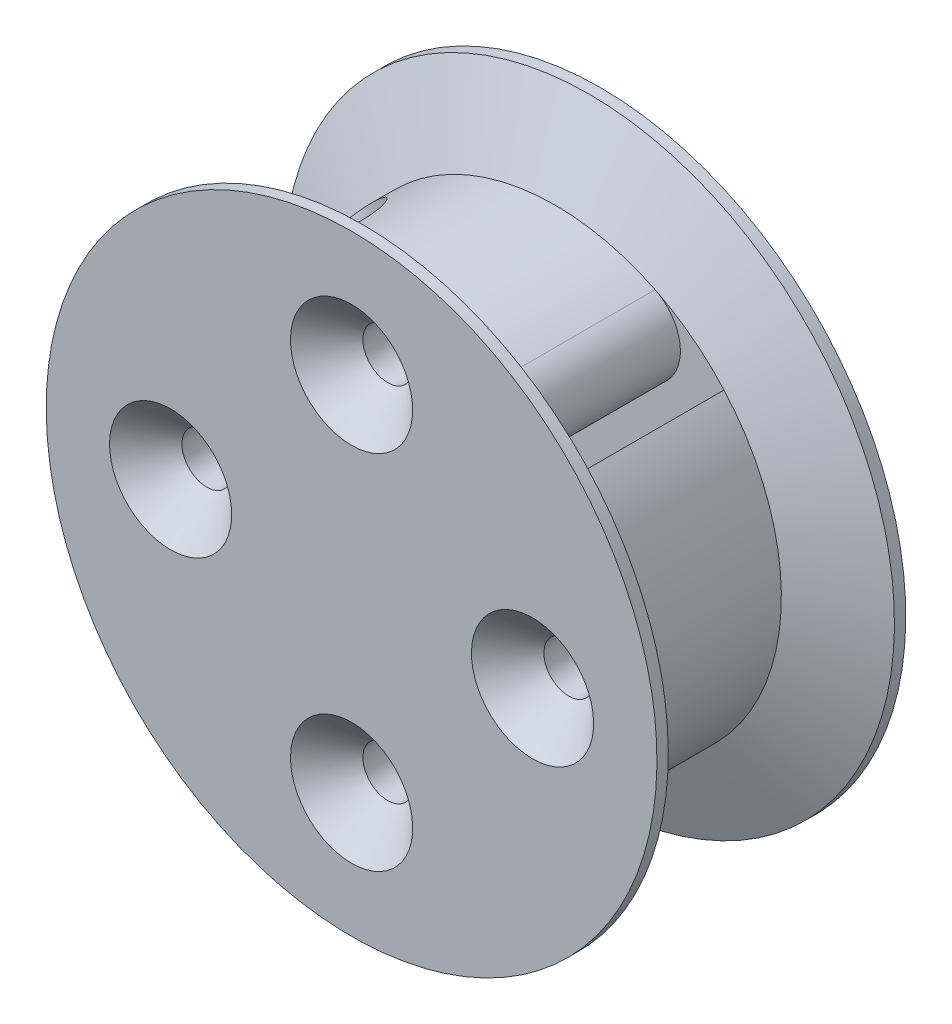
ISO-10303-21;
HEADER;
FILE_DESCRIPTION(('STEP AP214'),'2;1');
FILE_NAME('part.step','',(''),(''),'','','');
FILE_SCHEMA(('AUTOMOTIVE_DESIGN { 1 0 10303 214 1 1 1 1 }'));
ENDSEC;
DATA;
#1=APPLICATION_CONTEXT('core data for automotive mechanical design processes');
#2=APPLICATION_PROTOCOL_DEFINITION('international standard','automotive_design',2000,#1);
#3=PRODUCT_CONTEXT('',#1,'mechanical');
#4=PRODUCT('Part','Part','',(#3));
#5=PRODUCT_RELATED_PRODUCT_CATEGORY('part','',(#4));
#6=PRODUCT_DEFINITION_FORMATION('','',#4);
#7=PRODUCT_DEFINITION_CONTEXT('part definition',#1,'design');
#8=PRODUCT_DEFINITION('design','',#6,#7);
#9=PRODUCT_DEFINITION_SHAPE('','',#8);
#10=(LENGTH_UNIT() NAMED_UNIT(*) SI_UNIT(.MILLI.,.METRE.));
#11=(NAMED_UNIT(*) PLANE_ANGLE_UNIT() SI_UNIT($,.RADIAN.));
#12=(NAMED_UNIT(*) SI_UNIT($,.STERADIAN.) SOLID_ANGLE_UNIT());
#13=UNCERTAINTY_MEASURE_WITH_UNIT(LENGTH_MEASURE(1.E-05),#10,'distance_accuracy_value','');
#14=(GEOMETRIC_REPRESENTATION_CONTEXT(3) GLOBAL_UNCERTAINTY_ASSIGNED_CONTEXT((#13)) GLOBAL_UNIT_ASSIGNED_CONTEXT((#10,
#11,#12)) REPRESENTATION_CONTEXT('',''));
#15=CARTESIAN_POINT('',(0.,0.,0.));
#16=DIRECTION('',(0.,0.,1.));
#17=DIRECTION('',(1.,0.,0.));
#18=AXIS2_PLACEMENT_3D('',#15,#16,#17);
#19=CARTESIAN_POINT('',(-50.4704222417557,-51.28359504012,30.0000000000011));
#20=DIRECTION('',(0.707106781186549,-0.707106781186546,0.));
#21=DIRECTION('',(0.707106781186546,0.707106781186549,0.));
#22=AXIS2_PLACEMENT_3D('',#19,#20,#21);
#23=PLANE('',#22);
#24=DIRECTION('',(0.707106781186546,0.707106781186549,0.));
#25=VECTOR('',#24,1.);
#26=CARTESIAN_POINT('',(-50.4704222417557,-51.28359504012,23.0000000000005));
#27=LINE('',#26,#25);
#28=CARTESIAN_POINT('',(2.13016700690346,1.31699420853935,23.0000000000005));
#29=VERTEX_POINT('',#28);
#30=CARTESIAN_POINT('',(7.46595517408539,6.6527823757213,23.0000000000005));
#31=VERTEX_POINT('',#30);
#32=EDGE_CURVE('E136',#29,#31,#27,.T.);
#33=ORIENTED_EDGE('',*,*,#32,.F.);
#34=DIRECTION('',(0.,0.,1.));
#35=VECTOR('',#34,1.);
#36=CARTESIAN_POINT('',(2.13016700690345,1.31699420853934,30.0000000000011));
#37=LINE('',#36,#35);
#38=CARTESIAN_POINT('',(2.13016700690346,1.31699420853935,30.0000000000011));
#39=VERTEX_POINT('',#38);
#40=EDGE_CURVE('E273',#29,#39,#37,.T.);
#41=ORIENTED_EDGE('',*,*,#40,.T.);
#42=DIRECTION('',(0.707106781186546,0.707106781186549,0.));
#43=VECTOR('',#42,1.);
#44=CARTESIAN_POINT('',(-50.4704222417557,-51.28359504012,30.0000000000011));
#45=LINE('',#44,#43);
#46=CARTESIAN_POINT('',(7.46595517408649,6.6527823757224,30.0000000000011));
#47=VERTEX_POINT('',#46);
#48=EDGE_CURVE('E156',#39,#47,#45,.T.);
#49=ORIENTED_EDGE('',*,*,#48,.T.);
#50=DIRECTION('',(0.,0.,-1.));
#51=VECTOR('',#50,1.);
#52=CARTESIAN_POINT('',(7.46595517408537,6.65278237572133,-215.080895435479));
#53=LINE('',#52,#51);
#54=EDGE_CURVE('E153',#47,#31,#53,.T.);
#55=ORIENTED_EDGE('',*,*,#54,.T.);
#56=EDGE_LOOP('',(#33,#41,#49,#55));
#57=FACE_BOUND('',#56,.T.);
#58=ADVANCED_FACE('F39',(#57),#23,.F.);
#59=CARTESIAN_POINT('',(-4.94922236327946,-5.76239516164358,23.0000000000005));
#60=VERTEX_POINT('',#59);
#61=CARTESIAN_POINT('',(-1.31699420853931,-2.13016700690342,23.0000000000005));
#62=VERTEX_POINT('',#61);
#63=EDGE_CURVE('E149',#60,#62,#27,.T.);
#64=ORIENTED_EDGE('',*,*,#63,.F.);
#65=DIRECTION('',(0.,0.,1.));
#66=VECTOR('',#65,1.);
#67=CARTESIAN_POINT('',(-4.94922236327946,-5.76239516164359,30.0000000000005));
#68=LINE('',#67,#66);
#69=CARTESIAN_POINT('',(-4.94922236327946,-5.76239516164358,30.0000000000011));
#70=VERTEX_POINT('',#69);
#71=EDGE_CURVE('E286',#60,#70,#68,.T.);
#72=ORIENTED_EDGE('',*,*,#71,.T.);
#73=CARTESIAN_POINT('',(-1.31699420853931,-2.13016700690342,30.0000000000011));
#74=VERTEX_POINT('',#73);
#75=EDGE_CURVE('E150',#70,#74,#45,.T.);
#76=ORIENTED_EDGE('',*,*,#75,.T.);
#77=DIRECTION('',(0.,0.,1.));
#78=VECTOR('',#77,1.);
#79=CARTESIAN_POINT('',(-1.31699420853931,-2.13016700690343,23.0000000000005));
#80=LINE('',#79,#78);
#81=EDGE_CURVE('E270',#74,#62,#80,.F.);
#82=ORIENTED_EDGE('',*,*,#81,.T.);
#83=EDGE_LOOP('',(#64,#72,#76,#82));
#84=FACE_BOUND('',#83,.T.);
#85=ADVANCED_FACE('F322',(#84),#23,.F.);
#86=CARTESIAN_POINT('',(0.,4.30211422042248E-13,-215.080895435479));
#87=DIRECTION('',(0.,0.,-1.));
#88=DIRECTION('',(0.,1.,0.));
#89=AXIS2_PLACEMENT_3D('',#86,#87,#88);
#90=CYLINDRICAL_SURFACE('',#89,10.0000000000077);
#91=CARTESIAN_POINT('',(0.,4.20745743243654E-13,30.0000000000005));
#92=DIRECTION('',(0.,0.,-1.));
#93=DIRECTION('',(0.,1.,0.));
#94=AXIS2_PLACEMENT_3D('',#91,#92,#93);
#95=CIRCLE('',#94,10.0000000000077);
#96=CARTESIAN_POINT('',(-7.46595517408648,-6.65278237572156,30.0000000000011));
#97=VERTEX_POINT('',#96);
#98=CARTESIAN_POINT('',(4.41876100113213,8.97076090502004,30.0000000000005));
#99=VERTEX_POINT('',#98);
#100=EDGE_CURVE('E184',#97,#99,#95,.T.);
#101=ORIENTED_EDGE('',*,*,#100,.T.);
#102=DIRECTION('',(0.,0.,-1.));
#103=VECTOR('',#102,1.);
#104=CARTESIAN_POINT('',(4.41876100113213,8.97076090502005,-215.080895435479));
#105=LINE('',#104,#103);
#106=CARTESIAN_POINT('',(4.41876100113213,8.97076090502004,23.0000000000005));
#107=VERTEX_POINT('',#106);
#108=EDGE_CURVE('E293',#99,#107,#105,.T.);
#109=ORIENTED_EDGE('',*,*,#108,.T.);
#110=CARTESIAN_POINT('',(0.,4.21016101940819E-13,23.0000000000005));
#111=DIRECTION('',(0.,0.,-1.));
#112=DIRECTION('',(0.,1.,0.));
#113=AXIS2_PLACEMENT_3D('',#110,#111,#112);
#114=CIRCLE('',#113,10.0000000000077);
#115=CARTESIAN_POINT('',(-7.46595517408538,-6.65278237572046,23.0000000000005));
#116=VERTEX_POINT('',#115);
#117=EDGE_CURVE('E176',#116,#107,#114,.T.);
#118=ORIENTED_EDGE('',*,*,#117,.F.);
#119=DIRECTION('',(0.,0.,-1.));
#120=VECTOR('',#119,1.);
#121=CARTESIAN_POINT('',(-7.46595517408536,-6.65278237572047,-215.080895435479));
#122=LINE('',#121,#120);
#123=EDGE_CURVE('E159',#97,#116,#122,.T.);
#124=ORIENTED_EDGE('',*,*,#123,.F.);
#125=EDGE_LOOP('',(#101,#109,#118,#124));
#126=FACE_BOUND('',#125,.T.);
#127=CARTESIAN_POINT('',(-8.61429892178676,5.07876501585399,26.5000000000005));
#128=CARTESIAN_POINT('',(-8.6142980124143,5.07876965218839,26.3619492490739));
#129=CARTESIAN_POINT('',(-8.6082962499833,5.0889886832791,26.2238551013219));
#130=CARTESIAN_POINT('',(-8.58430584205844,5.12934940483642,25.9516324218269));
#131=CARTESIAN_POINT('',(-8.56631022024562,5.15950269013004,25.8175062455323));
#132=CARTESIAN_POINT('',(-8.51842944101504,5.23817352869035,25.5571964618133));
#133=CARTESIAN_POINT('',(-8.48855963071312,5.2866673732873,25.4310028446147));
#134=CARTESIAN_POINT('',(-8.41704773470187,5.39979320112029,25.1896891474606));
#135=CARTESIAN_POINT('',(-8.37540514918983,5.46442586950216,25.0745695379202));
#136=CARTESIAN_POINT('',(-8.27959503600572,5.60855796273291,24.8561383547382));
#137=CARTESIAN_POINT('',(-8.22519538309569,5.68832692781949,24.7531063996504));
#138=CARTESIAN_POINT('',(-8.10472415497726,5.85869554040844,24.5642386056401));
#139=CARTESIAN_POINT('',(-8.03865148964896,5.94929619920589,24.4784043743787));
#140=CARTESIAN_POINT('',(-7.89452855872655,6.13928418248645,24.3252245323692));
#141=CARTESIAN_POINT('',(-7.8163240293497,6.23877647094097,24.258153611839));
#142=CARTESIAN_POINT('',(-7.64988513149789,6.44177455043508,24.1461903558474));
#143=CARTESIAN_POINT('',(-7.56165224522304,6.54527974687712,24.1012947480849));
#144=CARTESIAN_POINT('',(-7.37894659257335,6.75052840938397,24.0358521654219));
#145=CARTESIAN_POINT('',(-7.28463644537037,6.85226508692304,24.0148303556739));
#146=CARTESIAN_POINT('',(-7.09070046218256,7.05275878211874,23.9962416207249));
#147=CARTESIAN_POINT('',(-6.99107541427229,7.15151623814295,23.9986712277909));
#148=CARTESIAN_POINT('',(-6.79176086778215,7.34101400502302,24.0265748502506));
#149=CARTESIAN_POINT('',(-6.69212185218547,7.43188358679216,24.0515363250543));
#150=CARTESIAN_POINT('',(-6.49375949365954,7.60582013210337,24.122971270049));
#151=CARTESIAN_POINT('',(-6.39503619975926,7.68888668000914,24.1694458853779));
#152=CARTESIAN_POINT('',(-6.20087274764011,7.84633392791923,24.2830025706876));
#153=CARTESIAN_POINT('',(-6.10547031387044,7.9206293656088,24.3502670446623));
#154=CARTESIAN_POINT('',(-5.92216777231291,8.05860472362642,24.5033556791168));
#155=CARTESIAN_POINT('',(-5.83426897347495,8.12228279367761,24.5891830685612));
#156=CARTESIAN_POINT('',(-5.66689661534657,8.23996639224701,24.7797087419829));
#157=CARTESIAN_POINT('',(-5.58771546803225,8.29366349256869,24.8848548923483));
#158=CARTESIAN_POINT('',(-5.44380969049345,8.38882591055176,25.1095999735409));
#159=CARTESIAN_POINT('',(-5.37908573596972,8.43029065652602,25.2291995794917));
#160=CARTESIAN_POINT('',(-5.26669722587487,8.50096167277904,25.4802900341494));
#161=CARTESIAN_POINT('',(-5.21911691142799,8.53010752800432,25.6118357303134));
#162=CARTESIAN_POINT('',(-5.1438287281712,8.57572065193251,25.8825854680774));
#163=CARTESIAN_POINT('',(-5.11611660682421,8.59219063380234,26.0217878639852));
#164=CARTESIAN_POINT('',(-5.08248832613073,8.61212445050481,26.2999595015305));
#165=CARTESIAN_POINT('',(-5.07601582027875,8.61592031634205,26.4388377933416));
#166=CARTESIAN_POINT('',(-5.0836426933116,8.61142245286822,26.7158219365858));
#167=CARTESIAN_POINT('',(-5.09774017848067,8.60312983644783,26.85392785795));
#168=CARTESIAN_POINT('',(-5.14536527546059,8.57472775430587,27.1231142649492));
#169=CARTESIAN_POINT('',(-5.17857120664476,8.55481385033115,27.2542727265698));
#170=CARTESIAN_POINT('',(-5.26256380152191,8.50340117239958,27.5084314578539));
#171=CARTESIAN_POINT('',(-5.31335254779405,8.4719010260941,27.6314307590564));
#172=CARTESIAN_POINT('',(-5.4314220336974,8.39670354947927,27.8684412778675));
#173=CARTESIAN_POINT('',(-5.49900675481824,8.35277906690013,27.9822288400436));
#174=CARTESIAN_POINT('',(-5.64732251964955,8.25322417603581,28.1951883628021));
#175=CARTESIAN_POINT('',(-5.72805572355327,8.19759184380262,28.2943579166507));
#176=CARTESIAN_POINT('',(-5.90173750975695,8.0734841869487,28.4778110425715));
#177=CARTESIAN_POINT('',(-5.99494119195945,8.0047223440283,28.5616600625494));
#178=CARTESIAN_POINT('',(-6.18839734836293,7.8561181765491,28.7089358669518));
#179=CARTESIAN_POINT('',(-6.28864945456348,7.77627643026386,28.7723637166088));
#180=CARTESIAN_POINT('',(-6.49180993403722,7.60747665555236,28.8764460345285));
#181=CARTESIAN_POINT('',(-6.59469340119525,7.51858986202858,28.9172642843796));
#182=CARTESIAN_POINT('',(-6.80023073532935,7.33321162424743,28.9754603346089));
#183=CARTESIAN_POINT('',(-6.90288464279622,7.23672165141149,28.9928426587395));
#184=CARTESIAN_POINT('',(-7.10187154087483,7.04147215390127,29.0034189739393));
#185=CARTESIAN_POINT('',(-7.19830039130777,6.9428445362357,28.997254272739));
#186=CARTESIAN_POINT('',(-7.38506999958035,6.74383906657155,28.9623804317646));
#187=CARTESIAN_POINT('',(-7.47541093839456,6.64346126671217,28.9336719624675));
#188=CARTESIAN_POINT('',(-7.64740467650401,6.44471844616534,28.8548694505732));
#189=CARTESIAN_POINT('',(-7.72910162923223,6.3463454989464,28.8048913667144));
#190=CARTESIAN_POINT('',(-7.88287932746659,6.1542965092489,28.6850735524514));
#191=CARTESIAN_POINT('',(-7.95495885908731,6.06062106060575,28.6152313183241));
#192=CARTESIAN_POINT('',(-8.09014025001643,5.87901052723982,28.45571191501));
#193=CARTESIAN_POINT('',(-8.15298566006389,5.79126672994169,28.3655996427407));
#194=CARTESIAN_POINT('',(-8.2670001817147,5.62731746285879,28.1689428700569));
#195=CARTESIAN_POINT('',(-8.31816632923708,5.55111492377831,28.0623942097224));
#196=CARTESIAN_POINT('',(-8.40933242244493,5.41204103369129,27.8334964645266));
#197=CARTESIAN_POINT('',(-8.44910624413112,5.34944491028958,27.7108896915871));
#198=CARTESIAN_POINT('',(-8.51598121335607,5.2423352760629,27.4548612753132));
#199=CARTESIAN_POINT('',(-8.54309158225397,5.19780861040755,27.3214475847656));
#200=CARTESIAN_POINT('',(-8.58063758053735,5.13553369206977,27.0735574704124));
#201=CARTESIAN_POINT('',(-8.59325622729519,5.11431500944359,26.960267089035));
#202=CARTESIAN_POINT('',(-8.61008692037333,5.08592932815243,26.7313278275062));
#203=CARTESIAN_POINT('',(-8.61429968379227,5.07876113085362,26.6156791493894));
#204=CARTESIAN_POINT('',(-8.61429892178676,5.07876501585399,26.5000000000005));
#205=B_SPLINE_CURVE_WITH_KNOTS('',3,(#127,#128,#129,#130,#131,#132,#133,#134,#135,#136,#137,
#138,#139,#140,#141,#142,#143,#144,#145,#146,#147,#148,#149,#150,#151,#152,#153,#154,#155,#156,
#157,#158,#159,#160,#161,#162,#163,#164,#165,#166,#167,#168,#169,#170,#171,#172,#173,#174,#175,
#176,#177,#178,#179,#180,#181,#182,#183,#184,#185,#186,#187,#188,#189,#190,#191,#192,#193,#194,
#195,#196,#197,#198,#199,#200,#201,#202,#203,#204),.UNSPECIFIED.,.T.,.F.,(4,2,2,2,2,2,2,2,2,2,2,
2,2,2,2,2,2,2,2,2,2,2,2,2,2,2,2,2,2,2,2,2,2,2,2,2,2,2,4),(0.,0.413727441736149,
0.827695741428687,1.24113072716605,1.65458326755482,2.0762395419298,2.49793521479871,
2.92551496397923,3.35303159847095,3.7718875099535,4.19068148666024,4.60018262688953,
5.00970556724794,5.42292874254453,5.83622385468923,6.26070466571921,6.68520531199811,
7.1117643200841,7.53823200129554,7.95343574764211,8.36860127188755,8.77697405014163,
9.18539521426375,9.60182845864117,10.0183301889,10.4452533097028,10.8721541572451,
11.2959207281189,11.71960548914,12.1318344613241,12.5440511738194,12.9540487656467,
13.3640980574303,13.7839709658703,14.2039503157047,14.6317647729115,15.0592672137503,
15.4059782718573,15.7526597510791),.UNSPECIFIED.);
#206=CARTESIAN_POINT('',(-8.61429892178676,5.07876501585399,26.5000000000005));
#207=VERTEX_POINT('',#206);
#208=EDGE_CURVE('E364',#207,#207,#205,.T.);
#209=ORIENTED_EDGE('',*,*,#208,.T.);
#210=EDGE_LOOP('',(#209));
#211=FACE_BOUND('',#210,.T.);
#212=ADVANCED_FACE('F303',(#126,#211),#90,.T.);
#213=CARTESIAN_POINT('',(0.,0.,22.15));
#214=DIRECTION('',(0.,0.,1.));
#215=DIRECTION('',(0.,-1.,0.));
#216=AXIS2_PLACEMENT_3D('',#213,#214,#215);
#217=PLANE('',#216);
#218=CARTESIAN_POINT('',(0.,4.2104893121119E-13,22.15));
#219=DIRECTION('',(0.,0.,-1.));
#220=DIRECTION('',(0.,1.,0.));
#221=AXIS2_PLACEMENT_3D('',#218,#219,#220);
#222=CIRCLE('',#221,5.00000000000773);
#223=CARTESIAN_POINT('',(0.,5.00000000000815,22.15));
#224=VERTEX_POINT('',#223);
#225=EDGE_CURVE('E373',#224,#224,#222,.T.);
#226=ORIENTED_EDGE('',*,*,#225,.T.);
#227=EDGE_LOOP('',(#226));
#228=FACE_BOUND('',#227,.T.);
#229=ADVANCED_FACE('F487',(#228),#217,.F.);
#230=CARTESIAN_POINT('',(0.,4.30211422042248E-13,-215.080895435479));
#231=DIRECTION('',(0.,0.,-1.));
#232=DIRECTION('',(0.,1.,0.));
#233=AXIS2_PLACEMENT_3D('',#230,#231,#232);
#234=CYLINDRICAL_SURFACE('',#233,5.00000000000773);
#235=ORIENTED_EDGE('',*,*,#225,.F.);
#236=EDGE_LOOP('',(#235));
#237=FACE_BOUND('',#236,.T.);
#238=CARTESIAN_POINT('',(0.,4.21160936957158E-13,19.25));
#239=DIRECTION('',(0.,0.,-1.));
#240=DIRECTION('',(0.,1.,0.));
#241=AXIS2_PLACEMENT_3D('',#238,#239,#240);
#242=CIRCLE('',#241,5.00000000000773);
#243=CARTESIAN_POINT('',(0.,5.00000000000816,19.25));
#244=VERTEX_POINT('',#243);
#245=EDGE_CURVE('E709',#244,#244,#242,.T.);
#246=ORIENTED_EDGE('',*,*,#245,.T.);
#247=EDGE_LOOP('',(#246));
#248=FACE_BOUND('',#247,.T.);
#249=ADVANCED_FACE('F541',(#237,#248),#234,.F.);
#250=CARTESIAN_POINT('',(0.,-4.0708177569652E-13,19.25));
#251=DIRECTION('',(0.,0.,1.));
#252=DIRECTION('',(0.,-1.,0.));
#253=AXIS2_PLACEMENT_3D('',#250,#251,#252);
#254=PLANE('',#253);
#255=CARTESIAN_POINT('',(-8.0000000000001,0.,19.25));
#256=DIRECTION('',(0.,0.,1.));
#257=DIRECTION('',(0.,-1.,0.));
#258=AXIS2_PLACEMENT_3D('',#255,#256,#257);
#259=CIRCLE('',#258,1.09999999999999);
#260=CARTESIAN_POINT('',(-8.0000000000001,-1.09999999999991,19.25));
#261=VERTEX_POINT('',#260);
#262=EDGE_CURVE('E210',#261,#261,#259,.T.);
#263=ORIENTED_EDGE('',*,*,#262,.T.);
#264=EDGE_LOOP('',(#263));
#265=FACE_BOUND('',#264,.T.);
#266=CARTESIAN_POINT('',(0.,-8.0000000000001,19.25));
#267=DIRECTION('',(0.,0.,1.));
#268=DIRECTION('',(0.,-1.,0.));
#269=AXIS2_PLACEMENT_3D('',#266,#267,#268);
#270=CIRCLE('',#269,1.09999999999999);
#271=CARTESIAN_POINT('',(0.,-9.10000000000009,19.25));
#272=VERTEX_POINT('',#271);
#273=EDGE_CURVE('E205',#272,#272,#270,.T.);
#274=ORIENTED_EDGE('',*,*,#273,.T.);
#275=EDGE_LOOP('',(#274));
#276=FACE_BOUND('',#275,.T.);
#277=CARTESIAN_POINT('',(8.0000000000001,0.,19.25));
#278=DIRECTION('',(0.,0.,1.));
#279=DIRECTION('',(0.,-1.,0.));
#280=AXIS2_PLACEMENT_3D('',#277,#278,#279);
#281=CIRCLE('',#280,1.09999999999999);
#282=CARTESIAN_POINT('',(8.0000000000001,-1.10000000000002,19.25));
#283=VERTEX_POINT('',#282);
#284=EDGE_CURVE('E200',#283,#283,#281,.T.);
#285=ORIENTED_EDGE('',*,*,#284,.T.);
#286=EDGE_LOOP('',(#285));
#287=FACE_BOUND('',#286,.T.);
#288=CARTESIAN_POINT('',(0.,8.0000000000001,19.25));
#289=DIRECTION('',(0.,0.,1.));
#290=DIRECTION('',(0.,-1.,0.));
#291=AXIS2_PLACEMENT_3D('',#288,#289,#290);
#292=CIRCLE('',#291,1.09999999999999);
#293=CARTESIAN_POINT('',(0.,6.90000000000011,19.25));
#294=VERTEX_POINT('',#293);
#295=EDGE_CURVE('E197',#294,#294,#292,.T.);
#296=ORIENTED_EDGE('',*,*,#295,.T.);
#297=EDGE_LOOP('',(#296));
#298=FACE_BOUND('',#297,.T.);
#299=ORIENTED_EDGE('',*,*,#245,.F.);
#300=EDGE_LOOP('',(#299));
#301=FACE_BOUND('',#300,.T.);
#302=CARTESIAN_POINT('',(0.,4.21160936957158E-13,19.2500000000001));
#303=DIRECTION('',(0.,0.,-1.));
#304=DIRECTION('',(0.,1.,0.));
#305=AXIS2_PLACEMENT_3D('',#302,#303,#304);
#306=CIRCLE('',#305,10.2499999999996);
#307=CARTESIAN_POINT('',(0.,10.25,19.2500000000001));
#308=VERTEX_POINT('',#307);
#309=EDGE_CURVE('E704',#308,#308,#306,.T.);
#310=ORIENTED_EDGE('',*,*,#309,.T.);
#311=EDGE_LOOP('',(#310));
#312=FACE_BOUND('',#311,.T.);
#313=ADVANCED_FACE('F550',(#265,#276,#287,#298,#301,#312),#254,.F.);
#314=CARTESIAN_POINT('',(0.,4.30211422042248E-13,-215.080895435479));
#315=DIRECTION('',(0.,0.,-1.));
#316=DIRECTION('',(0.,1.,0.));
#317=AXIS2_PLACEMENT_3D('',#314,#315,#316);
#318=CYLINDRICAL_SURFACE('',#317,10.2499999999996);
#319=CARTESIAN_POINT('',(0.,4.21093347282867E-13,21.0000000000005));
#320=DIRECTION('',(0.,0.,-1.));
#321=DIRECTION('',(0.,1.,0.));
#322=AXIS2_PLACEMENT_3D('',#319,#320,#321);
#323=CIRCLE('',#322,10.2499999999996);
#324=CARTESIAN_POINT('',(0.,10.25,21.0000000000005));
#325=VERTEX_POINT('',#324);
#326=EDGE_CURVE('E701',#325,#325,#323,.T.);
#327=ORIENTED_EDGE('',*,*,#326,.T.);
#328=EDGE_LOOP('',(#327));
#329=FACE_BOUND('',#328,.T.);
#330=ORIENTED_EDGE('',*,*,#309,.F.);
#331=EDGE_LOOP('',(#330));
#332=FACE_BOUND('',#331,.T.);
#333=ADVANCED_FACE('F559',(#329,#332),#318,.T.);
#334=CARTESIAN_POINT('',(0.,0.,21.0000000000005));
#335=DIRECTION('',(0.,0.,1.));
#336=DIRECTION('',(0.,-1.,0.));
#337=AXIS2_PLACEMENT_3D('',#334,#335,#336);
#338=PLANE('',#337);
#339=ORIENTED_EDGE('',*,*,#326,.F.);
#340=EDGE_LOOP('',(#339));
#341=FACE_BOUND('',#340,.T.);
#342=CARTESIAN_POINT('',(0.,4.21093347282867E-13,21.0000000000005));
#343=DIRECTION('',(0.,0.,-1.));
#344=DIRECTION('',(0.,1.,0.));
#345=AXIS2_PLACEMENT_3D('',#342,#343,#344);
#346=CIRCLE('',#345,13.5000000000077);
#347=CARTESIAN_POINT('',(0.,13.5000000000082,21.0000000000005));
#348=VERTEX_POINT('',#347);
#349=EDGE_CURVE('E180',#348,#348,#346,.T.);
#350=ORIENTED_EDGE('',*,*,#349,.T.);
#351=EDGE_LOOP('',(#350));
#352=FACE_BOUND('',#351,.T.);
#353=ADVANCED_FACE('F568',(#341,#352),#338,.F.);
#354=CARTESIAN_POINT('',(0.,4.30211422042248E-13,-215.080895435479));
#355=DIRECTION('',(0.,0.,-1.));
#356=DIRECTION('',(0.,1.,0.));
#357=AXIS2_PLACEMENT_3D('',#354,#355,#356);
#358=CYLINDRICAL_SURFACE('',#357,13.5000000000077);
#359=ORIENTED_EDGE('',*,*,#349,.F.);
#360=EDGE_LOOP('',(#359));
#361=FACE_BOUND('',#360,.T.);
#362=CARTESIAN_POINT('',(0.,4.21074035947355E-13,21.5000000000005));
#363=DIRECTION('',(0.,0.,-1.));
#364=DIRECTION('',(0.,1.,0.));
#365=AXIS2_PLACEMENT_3D('',#362,#363,#364);
#366=CIRCLE('',#365,13.5000000000077);
#367=CARTESIAN_POINT('',(0.,13.5000000000082,21.5000000000005));
#368=VERTEX_POINT('',#367);
#369=EDGE_CURVE('E178',#368,#368,#366,.T.);
#370=ORIENTED_EDGE('',*,*,#369,.T.);
#371=EDGE_LOOP('',(#370));
#372=FACE_BOUND('',#371,.T.);
#373=ADVANCED_FACE('F496',(#361,#372),#358,.T.);
#374=CARTESIAN_POINT('',(0.,4.21016101940819E-13,23.0000000000005));
#375=DIRECTION('',(0.,0.,-1.));
#376=DIRECTION('',(0.,1.,0.));
#377=AXIS2_PLACEMENT_3D('',#374,#375,#376);
#378=CONICAL_SURFACE('',#377,10.0000000000077,1.16590454050981);
#379=ORIENTED_EDGE('',*,*,#369,.F.);
#380=EDGE_LOOP('',(#379));
#381=FACE_BOUND('',#380,.T.);
#382=EDGE_CURVE('E141',#107,#31,#114,.T.);
#383=ORIENTED_EDGE('',*,*,#382,.T.);
#384=CARTESIAN_POINT('',(-4.41876100113213,-8.9707609050192,23.0000000000005));
#385=VERTEX_POINT('',#384);
#386=EDGE_CURVE('E164',#31,#385,#114,.T.);
#387=ORIENTED_EDGE('',*,*,#386,.T.);
#388=EDGE_CURVE('E171',#385,#116,#114,.T.);
#389=ORIENTED_EDGE('',*,*,#388,.T.);
#390=ORIENTED_EDGE('',*,*,#117,.T.);
#391=EDGE_LOOP('',(#383,#387,#389,#390));
#392=FACE_BOUND('',#391,.T.);
#393=ADVANCED_FACE('F174',(#381,#392),#378,.T.);
#394=CARTESIAN_POINT('',(-4.41876100113213,-8.9707609050192,30.0000000000005));
#395=VERTEX_POINT('',#394);
#396=EDGE_CURVE('E183',#47,#395,#95,.T.);
#397=ORIENTED_EDGE('',*,*,#396,.T.);
#398=DIRECTION('',(0.,0.,-1.));
#399=VECTOR('',#398,1.);
#400=CARTESIAN_POINT('',(-4.41876100113213,-8.97076090501919,-215.080895435479));
#401=LINE('',#400,#399);
#402=EDGE_CURVE('E167',#395,#385,#401,.T.);
#403=ORIENTED_EDGE('',*,*,#402,.T.);
#404=ORIENTED_EDGE('',*,*,#386,.F.);
#405=ORIENTED_EDGE('',*,*,#54,.F.);
#406=EDGE_LOOP('',(#397,#403,#404,#405));
#407=FACE_BOUND('',#406,.T.);
#408=ADVANCED_FACE('F165',(#407),#90,.T.);
#409=CARTESIAN_POINT('',(0.,4.20745743243654E-13,30.0000000000005));
#410=DIRECTION('',(0.,0.,1.));
#411=DIRECTION('',(0.,-1.,0.));
#412=AXIS2_PLACEMENT_3D('',#409,#410,#411);
#413=CONICAL_SURFACE('',#412,10.0000000000077,1.16590454050981);
#414=CARTESIAN_POINT('',(0.,4.20687809237118E-13,31.5000000000005));
#415=DIRECTION('',(0.,0.,-1.));
#416=DIRECTION('',(0.,1.,0.));
#417=AXIS2_PLACEMENT_3D('',#414,#415,#416);
#418=CIRCLE('',#417,13.5000000000077);
#419=CARTESIAN_POINT('',(0.,13.5000000000082,31.5000000000005));
#420=VERTEX_POINT('',#419);
#421=EDGE_CURVE('E189',#420,#420,#418,.T.);
#422=ORIENTED_EDGE('',*,*,#421,.T.);
#423=EDGE_LOOP('',(#422));
#424=FACE_BOUND('',#423,.T.);
#425=EDGE_CURVE('E55',#99,#47,#95,.T.);
#426=ORIENTED_EDGE('',*,*,#425,.F.);
#427=ORIENTED_EDGE('',*,*,#100,.F.);
#428=EDGE_CURVE('E187',#395,#97,#95,.T.);
#429=ORIENTED_EDGE('',*,*,#428,.F.);
#430=ORIENTED_EDGE('',*,*,#396,.F.);
#431=EDGE_LOOP('',(#426,#427,#429,#430));
#432=FACE_BOUND('',#431,.T.);
#433=ADVANCED_FACE('F355',(#424,#432),#413,.T.);
#434=CARTESIAN_POINT('',(0.,4.30211422042248E-13,-215.080895435479));
#435=DIRECTION('',(0.,0.,-1.));
#436=DIRECTION('',(0.,1.,0.));
#437=AXIS2_PLACEMENT_3D('',#434,#435,#436);
#438=CYLINDRICAL_SURFACE('',#437,13.5000000000077);
#439=CARTESIAN_POINT('',(0.,4.20668497901606E-13,32.0000000000005));
#440=DIRECTION('',(0.,0.,-1.));
#441=DIRECTION('',(0.,1.,0.));
#442=AXIS2_PLACEMENT_3D('',#439,#440,#441);
#443=CIRCLE('',#442,13.5000000000077);
#444=CARTESIAN_POINT('',(0.,13.5000000000082,32.0000000000005));
#445=VERTEX_POINT('',#444);
#446=EDGE_CURVE('E193',#445,#445,#443,.T.);
#447=ORIENTED_EDGE('',*,*,#446,.T.);
#448=EDGE_LOOP('',(#447));
#449=FACE_BOUND('',#448,.T.);
#450=ORIENTED_EDGE('',*,*,#421,.F.);
#451=EDGE_LOOP('',(#450));
#452=FACE_BOUND('',#451,.T.);
#453=ADVANCED_FACE('F351',(#449,#452),#438,.T.);
#454=CARTESIAN_POINT('',(0.,2.4211085811093E-11,32.0000000000056));
#455=DIRECTION('',(0.,0.,1.));
#456=DIRECTION('',(0.,-1.,0.));
#457=AXIS2_PLACEMENT_3D('',#454,#455,#456);
#458=PLANE('',#457);
#459=CARTESIAN_POINT('',(-8.0000000000001,0.,32.0000000000056));
#460=DIRECTION('',(0.,0.,1.));
#461=DIRECTION('',(0.,-1.,0.));
#462=AXIS2_PLACEMENT_3D('',#459,#460,#461);
#463=CIRCLE('',#462,2.7);
#464=CARTESIAN_POINT('',(-8.0000000000001,-2.69999999999992,32.0000000000056));
#465=VERTEX_POINT('',#464);
#466=EDGE_CURVE('E215',#465,#465,#463,.T.);
#467=ORIENTED_EDGE('',*,*,#466,.F.);
#468=EDGE_LOOP('',(#467));
#469=FACE_BOUND('',#468,.T.);
#470=CARTESIAN_POINT('',(0.,-8.0000000000001,32.0000000000056));
#471=DIRECTION('',(0.,0.,1.));
#472=DIRECTION('',(0.,-1.,0.));
#473=AXIS2_PLACEMENT_3D('',#470,#471,#472);
#474=CIRCLE('',#473,2.7);
#475=CARTESIAN_POINT('',(0.,-10.7000000000001,32.0000000000056));
#476=VERTEX_POINT('',#475);
#477=EDGE_CURVE('E213',#476,#476,#474,.T.);
#478=ORIENTED_EDGE('',*,*,#477,.F.);
#479=EDGE_LOOP('',(#478));
#480=FACE_BOUND('',#479,.T.);
#481=CARTESIAN_POINT('',(8.0000000000001,0.,32.0000000000056));
#482=DIRECTION('',(0.,0.,1.));
#483=DIRECTION('',(0.,-1.,0.));
#484=AXIS2_PLACEMENT_3D('',#481,#482,#483);
#485=CIRCLE('',#484,2.7);
#486=CARTESIAN_POINT('',(8.0000000000001,-2.70000000000003,32.0000000000056));
#487=VERTEX_POINT('',#486);
#488=EDGE_CURVE('E208',#487,#487,#485,.T.);
#489=ORIENTED_EDGE('',*,*,#488,.F.);
#490=EDGE_LOOP('',(#489));
#491=FACE_BOUND('',#490,.T.);
#492=CARTESIAN_POINT('',(0.,8.0000000000001,32.0000000000056));
#493=DIRECTION('',(0.,0.,1.));
#494=DIRECTION('',(0.,-1.,0.));
#495=AXIS2_PLACEMENT_3D('',#492,#493,#494);
#496=CIRCLE('',#495,2.7);
#497=CARTESIAN_POINT('',(0.,5.30000000000009,32.0000000000056));
#498=VERTEX_POINT('',#497);
#499=EDGE_CURVE('E203',#498,#498,#496,.T.);
#500=ORIENTED_EDGE('',*,*,#499,.F.);
#501=EDGE_LOOP('',(#500));
#502=FACE_BOUND('',#501,.T.);
#503=ORIENTED_EDGE('',*,*,#446,.F.);
#504=EDGE_LOOP('',(#503));
#505=FACE_BOUND('',#504,.T.);
#506=ADVANCED_FACE('F347',(#469,#480,#491,#502,#505),#458,.T.);
#507=CARTESIAN_POINT('',(0.,8.0000000000001,32.0000000000056));
#508=DIRECTION('',(0.,0.,1.));
#509=DIRECTION('',(1.,0.,0.));
#510=AXIS2_PLACEMENT_3D('',#507,#508,#509);
#511=CYLINDRICAL_SURFACE('',#510,1.09999999999999);
#512=CARTESIAN_POINT('',(0.,8.0000000000001,30.4000000000056));
#513=DIRECTION('',(0.,0.,1.));
#514=DIRECTION('',(1.,0.,0.));
#515=AXIS2_PLACEMENT_3D('',#512,#513,#514);
#516=CIRCLE('',#515,1.09999999999999);
#517=CARTESIAN_POINT('',(1.09999999999999,8.0000000000001,30.4000000000056));
#518=VERTEX_POINT('',#517);
#519=EDGE_CURVE('E716',#518,#518,#516,.T.);
#520=ORIENTED_EDGE('',*,*,#519,.T.);
#521=EDGE_LOOP('',(#520));
#522=FACE_BOUND('',#521,.T.);
#523=ORIENTED_EDGE('',*,*,#295,.F.);
#524=EDGE_LOOP('',(#523));
#525=FACE_BOUND('',#524,.T.);
#526=ADVANCED_FACE('F344',(#522,#525),#511,.F.);
#527=CARTESIAN_POINT('',(0.,8.0000000000001,31.5000000000056));
#528=DIRECTION('',(0.,0.,1.));
#529=DIRECTION('',(1.,0.,0.));
#530=AXIS2_PLACEMENT_3D('',#527,#528,#529);
#531=CONICAL_SURFACE('',#530,2.2,0.785398163397451);
#532=ORIENTED_EDGE('',*,*,#519,.F.);
#533=EDGE_LOOP('',(#532));
#534=FACE_BOUND('',#533,.T.);
#535=ORIENTED_EDGE('',*,*,#499,.T.);
#536=EDGE_LOOP('',(#535));
#537=FACE_BOUND('',#536,.T.);
#538=ADVANCED_FACE('F342',(#534,#537),#531,.F.);
#539=CARTESIAN_POINT('',(8.0000000000001,0.,32.0000000000056));
#540=DIRECTION('',(0.,0.,1.));
#541=DIRECTION('',(0.,-1.,0.));
#542=AXIS2_PLACEMENT_3D('',#539,#540,#541);
#543=CYLINDRICAL_SURFACE('',#542,1.09999999999999);
#544=ORIENTED_EDGE('',*,*,#284,.F.);
#545=EDGE_LOOP('',(#544));
#546=FACE_BOUND('',#545,.T.);
#547=CARTESIAN_POINT('',(8.0000000000001,0.,30.4000000000056));
#548=DIRECTION('',(0.,0.,1.));
#549=DIRECTION('',(0.,-1.,0.));
#550=AXIS2_PLACEMENT_3D('',#547,#548,#549);
#551=CIRCLE('',#550,1.09999999999999);
#552=CARTESIAN_POINT('',(8.0000000000001,-1.10000000000002,30.4000000000056));
#553=VERTEX_POINT('',#552);
#554=EDGE_CURVE('E204',#553,#553,#551,.T.);
#555=ORIENTED_EDGE('',*,*,#554,.T.);
#556=EDGE_LOOP('',(#555));
#557=FACE_BOUND('',#556,.T.);
#558=ADVANCED_FACE('F339',(#546,#557),#543,.F.);
#559=CARTESIAN_POINT('',(8.0000000000001,0.,31.5000000000056));
#560=DIRECTION('',(0.,0.,1.));
#561=DIRECTION('',(0.,-1.,0.));
#562=AXIS2_PLACEMENT_3D('',#559,#560,#561);
#563=CONICAL_SURFACE('',#562,2.2,0.785398163397451);
#564=ORIENTED_EDGE('',*,*,#554,.F.);
#565=EDGE_LOOP('',(#564));
#566=FACE_BOUND('',#565,.T.);
#567=ORIENTED_EDGE('',*,*,#488,.T.);
#568=EDGE_LOOP('',(#567));
#569=FACE_BOUND('',#568,.T.);
#570=ADVANCED_FACE('F337',(#566,#569),#563,.F.);
#571=CARTESIAN_POINT('',(0.,-8.0000000000001,32.0000000000056));
#572=DIRECTION('',(0.,0.,1.));
#573=DIRECTION('',(0.,-1.,0.));
#574=AXIS2_PLACEMENT_3D('',#571,#572,#573);
#575=CYLINDRICAL_SURFACE('',#574,1.09999999999999);
#576=ORIENTED_EDGE('',*,*,#273,.F.);
#577=EDGE_LOOP('',(#576));
#578=FACE_BOUND('',#577,.T.);
#579=CARTESIAN_POINT('',(0.,-8.0000000000001,30.4000000000056));
#580=DIRECTION('',(0.,0.,1.));
#581=DIRECTION('',(0.,-1.,0.));
#582=AXIS2_PLACEMENT_3D('',#579,#580,#581);
#583=CIRCLE('',#582,1.09999999999999);
#584=CARTESIAN_POINT('',(0.,-9.10000000000009,30.4000000000056));
#585=VERTEX_POINT('',#584);
#586=EDGE_CURVE('E209',#585,#585,#583,.T.);
#587=ORIENTED_EDGE('',*,*,#586,.T.);
#588=EDGE_LOOP('',(#587));
#589=FACE_BOUND('',#588,.T.);
#590=ADVANCED_FACE('F334',(#578,#589),#575,.F.);
#591=CARTESIAN_POINT('',(0.,-8.0000000000001,31.5000000000056));
#592=DIRECTION('',(0.,0.,1.));
#593=DIRECTION('',(0.,-1.,0.));
#594=AXIS2_PLACEMENT_3D('',#591,#592,#593);
#595=CONICAL_SURFACE('',#594,2.2,0.785398163397451);
#596=ORIENTED_EDGE('',*,*,#586,.F.);
#597=EDGE_LOOP('',(#596));
#598=FACE_BOUND('',#597,.T.);
#599=ORIENTED_EDGE('',*,*,#477,.T.);
#600=EDGE_LOOP('',(#599));
#601=FACE_BOUND('',#600,.T.);
#602=ADVANCED_FACE('F332',(#598,#601),#595,.F.);
#603=CARTESIAN_POINT('',(-8.0000000000001,0.,32.0000000000056));
#604=DIRECTION('',(0.,0.,1.));
#605=DIRECTION('',(0.,-1.,0.));
#606=AXIS2_PLACEMENT_3D('',#603,#604,#605);
#607=CYLINDRICAL_SURFACE('',#606,1.09999999999999);
#608=ORIENTED_EDGE('',*,*,#262,.F.);
#609=EDGE_LOOP('',(#608));
#610=FACE_BOUND('',#609,.T.);
#611=CARTESIAN_POINT('',(-8.0000000000001,0.,30.4000000000056));
#612=DIRECTION('',(0.,0.,1.));
#613=DIRECTION('',(0.,-1.,0.));
#614=AXIS2_PLACEMENT_3D('',#611,#612,#613);
#615=CIRCLE('',#614,1.09999999999999);
#616=CARTESIAN_POINT('',(-8.0000000000001,-1.09999999999991,30.4000000000056));
#617=VERTEX_POINT('',#616);
#618=EDGE_CURVE('E214',#617,#617,#615,.T.);
#619=ORIENTED_EDGE('',*,*,#618,.T.);
#620=EDGE_LOOP('',(#619));
#621=FACE_BOUND('',#620,.T.);
#622=ADVANCED_FACE('F329',(#610,#621),#607,.F.);
#623=CARTESIAN_POINT('',(-8.0000000000001,0.,31.5000000000056));
#624=DIRECTION('',(0.,0.,1.));
#625=DIRECTION('',(0.,-1.,0.));
#626=AXIS2_PLACEMENT_3D('',#623,#624,#625);
#627=CONICAL_SURFACE('',#626,2.2,0.785398163397451);
#628=ORIENTED_EDGE('',*,*,#618,.F.);
#629=EDGE_LOOP('',(#628));
#630=FACE_BOUND('',#629,.T.);
#631=ORIENTED_EDGE('',*,*,#466,.T.);
#632=EDGE_LOOP('',(#631));
#633=FACE_BOUND('',#632,.T.);
#634=ADVANCED_FACE('F318',(#630,#633),#627,.F.);
#635=CARTESIAN_POINT('',(-50.4704222417557,-51.28359504012,30.0000000000011));
#636=DIRECTION('',(0.,0.,1.));
#637=DIRECTION('',(0.,-1.,0.));
#638=AXIS2_PLACEMENT_3D('',#635,#636,#637);
#639=PLANE('',#638);
#640=DIRECTION('',(0.500000000000009,-0.866025403784433,0.));
#641=VECTOR('',#640,1.);
#642=CARTESIAN_POINT('',(1.85887594860977,1.04570315024562,30.0000000000011));
#643=LINE('',#642,#641);
#644=CARTESIAN_POINT('',(2.05070769560449,0.713440817946065,30.0000000000011));
#645=VERTEX_POINT('',#644);
#646=CARTESIAN_POINT('',(3.21995847223016,-1.31176093395892,30.0000000000011));
#647=VERTEX_POINT('',#646);
#648=EDGE_CURVE('E242',#645,#647,#643,.T.);
#649=ORIENTED_EDGE('',*,*,#648,.T.);
#650=CARTESIAN_POINT('',(2.78694577033795,-1.56176093395892,30.0000000000011));
#651=DIRECTION('',(0.,0.,1.));
#652=DIRECTION('',(0.,-1.,0.));
#653=AXIS2_PLACEMENT_3D('',#650,#651,#652);
#654=CIRCLE('',#653,0.5);
#655=CARTESIAN_POINT('',(3.14049916093122,-1.9153143245522,30.0000000000011));
#656=VERTEX_POINT('',#655);
#657=EDGE_CURVE('E775',#647,#656,#654,.F.);
#658=ORIENTED_EDGE('',*,*,#657,.T.);
#659=DIRECTION('',(-0.707106781186548,-0.707106781186547,0.));
#660=VECTOR('',#659,1.);
#661=CARTESIAN_POINT('',(3.41179021922491,-1.64402326625851,30.0000000000011));
#662=LINE('',#661,#660);
#663=CARTESIAN_POINT('',(1.91531432455223,-3.14049916093119,30.0000000000011));
#664=VERTEX_POINT('',#663);
#665=EDGE_CURVE('E245',#656,#664,#662,.T.);
#666=ORIENTED_EDGE('',*,*,#665,.T.);
#667=CARTESIAN_POINT('',(1.56176093395895,-2.78694577033792,30.0000000000011));
#668=DIRECTION('',(0.,0.,1.));
#669=DIRECTION('',(0.,-1.,0.));
#670=AXIS2_PLACEMENT_3D('',#667,#668,#669);
#671=CIRCLE('',#670,0.5);
#672=CARTESIAN_POINT('',(1.31176093395895,-3.21995847223014,30.0000000000011));
#673=VERTEX_POINT('',#672);
#674=EDGE_CURVE('E255',#664,#673,#671,.F.);
#675=ORIENTED_EDGE('',*,*,#674,.T.);
#676=DIRECTION('',(-0.866025403784437,0.500000000000002,0.));
#677=VECTOR('',#676,1.);
#678=CARTESIAN_POINT('',(1.64402326625854,-3.41179021922488,30.0000000000011));
#679=LINE('',#678,#677);
#680=CARTESIAN_POINT('',(-0.713440817946041,-2.05070769560448,30.0000000000011));
#681=VERTEX_POINT('',#680);
#682=EDGE_CURVE('E237',#673,#681,#679,.T.);
#683=ORIENTED_EDGE('',*,*,#682,.T.);
#684=CARTESIAN_POINT('',(-0.963440817946042,-2.4837203974967,30.0000000000011));
#685=DIRECTION('',(0.,0.,1.));
#686=DIRECTION('',(0.,-1.,0.));
#687=AXIS2_PLACEMENT_3D('',#684,#685,#686);
#688=CIRCLE('',#687,0.5);
#689=EDGE_CURVE('E253',#681,#74,#688,.T.);
#690=ORIENTED_EDGE('',*,*,#689,.T.);
#691=ORIENTED_EDGE('',*,*,#75,.F.);
#692=CARTESIAN_POINT('',(-3.53500880090639,-7.17660872401666,30.0000000000011));
#693=DIRECTION('',(0.,0.,1.));
#694=DIRECTION('',(0.,-1.,0.));
#695=AXIS2_PLACEMENT_3D('',#692,#693,#694);
#696=CIRCLE('',#695,2.);
#697=EDGE_CURVE('E295',#70,#395,#696,.T.);
#698=ORIENTED_EDGE('',*,*,#697,.T.);
#699=ORIENTED_EDGE('',*,*,#428,.T.);
#700=DIRECTION('',(0.707106781186546,0.707106781186549,0.));
#701=VECTOR('',#700,1.);
#702=CARTESIAN_POINT('',(-51.2835950401202,-50.4704222417555,30.0000000000011));
#703=LINE('',#702,#701);
#704=CARTESIAN_POINT('',(4.94922236327946,5.76239516164444,30.0000000000011));
#705=VERTEX_POINT('',#704);
#706=EDGE_CURVE('E160',#97,#705,#703,.T.);
#707=ORIENTED_EDGE('',*,*,#706,.T.);
#708=CARTESIAN_POINT('',(3.53500880090639,7.17660872401751,30.0000000000011));
#709=DIRECTION('',(0.,0.,1.));
#710=DIRECTION('',(0.,-1.,0.));
#711=AXIS2_PLACEMENT_3D('',#708,#709,#710);
#712=CIRCLE('',#711,2.);
#713=EDGE_CURVE('E48',#705,#99,#712,.T.);
#714=ORIENTED_EDGE('',*,*,#713,.T.);
#715=ORIENTED_EDGE('',*,*,#425,.T.);
#716=ORIENTED_EDGE('',*,*,#48,.F.);
#717=CARTESIAN_POINT('',(2.48372039749672,0.963440817946075,30.0000000000011));
#718=DIRECTION('',(0.,0.,1.));
#719=DIRECTION('',(0.,-1.,0.));
#720=AXIS2_PLACEMENT_3D('',#717,#718,#719);
#721=CIRCLE('',#720,0.5);
#722=EDGE_CURVE('E283',#39,#645,#721,.T.);
#723=ORIENTED_EDGE('',*,*,#722,.T.);
#724=EDGE_LOOP('',(#649,#658,#666,#675,#683,#690,#691,#698,#699,#707,#714,#715,#716,#723));
#725=FACE_BOUND('',#724,.T.);
#726=ADVANCED_FACE('F251',(#725),#639,.F.);
#727=CARTESIAN_POINT('',(-51.2835950401202,-50.4704222417555,30.0000000000011));
#728=DIRECTION('',(-0.707106781186549,0.707106781186546,0.));
#729=DIRECTION('',(-0.707106781186546,-0.707106781186549,0.));
#730=AXIS2_PLACEMENT_3D('',#727,#728,#729);
#731=PLANE('',#730);
#732=CARTESIAN_POINT('',(-0.406586399182477,0.406586399182475,26.5000000000005));
#733=DIRECTION('',(-0.707106781186549,0.707106781186546,0.));
#734=DIRECTION('',(-0.707106781186546,-0.707106781186549,0.));
#735=AXIS2_PLACEMENT_3D('',#732,#733,#734);
#736=CIRCLE('',#735,1.55);
#737=CARTESIAN_POINT('',(-1.50260191002162,-0.689429111656675,26.5000000000005));
#738=VERTEX_POINT('',#737);
#739=EDGE_CURVE('E223',#738,#738,#736,.T.);
#740=ORIENTED_EDGE('',*,*,#739,.T.);
#741=EDGE_LOOP('',(#740));
#742=FACE_BOUND('',#741,.T.);
#743=DIRECTION('',(0.707106781186546,0.707106781186549,0.));
#744=VECTOR('',#743,1.);
#745=CARTESIAN_POINT('',(-51.2835950401202,-50.4704222417555,23.0000000000005));
#746=LINE('',#745,#744);
#747=CARTESIAN_POINT('',(4.94922236327946,5.76239516164444,23.0000000000005));
#748=VERTEX_POINT('',#747);
#749=EDGE_CURVE('E218',#116,#748,#746,.T.);
#750=ORIENTED_EDGE('',*,*,#749,.T.);
#751=DIRECTION('',(0.,0.,1.));
#752=VECTOR('',#751,1.);
#753=CARTESIAN_POINT('',(4.94922236327947,5.76239516164443,30.0000000000005));
#754=LINE('',#753,#752);
#755=EDGE_CURVE('E290',#748,#705,#754,.T.);
#756=ORIENTED_EDGE('',*,*,#755,.T.);
#757=ORIENTED_EDGE('',*,*,#706,.F.);
#758=ORIENTED_EDGE('',*,*,#123,.T.);
#759=EDGE_LOOP('',(#750,#756,#757,#758));
#760=FACE_BOUND('',#759,.T.);
#761=ADVANCED_FACE('F308',(#742,#760),#731,.F.);
#762=CARTESIAN_POINT('',(-50.4704222417557,-51.28359504012,23.0000000000005));
#763=DIRECTION('',(0.,0.,-1.));
#764=DIRECTION('',(0.,1.,0.));
#765=AXIS2_PLACEMENT_3D('',#762,#763,#764);
#766=PLANE('',#765);
#767=DIRECTION('',(-0.707106781186548,-0.707106781186547,0.));
#768=VECTOR('',#767,1.);
#769=CARTESIAN_POINT('',(3.41179021922491,-1.64402326625851,23.0000000000005));
#770=LINE('',#769,#768);
#771=CARTESIAN_POINT('',(3.14049916093122,-1.9153143245522,23.0000000000005));
#772=VERTEX_POINT('',#771);
#773=CARTESIAN_POINT('',(1.91531432455223,-3.14049916093119,23.0000000000005));
#774=VERTEX_POINT('',#773);
#775=EDGE_CURVE('E232',#772,#774,#770,.T.);
#776=ORIENTED_EDGE('',*,*,#775,.F.);
#777=CARTESIAN_POINT('',(2.78694577033795,-1.56176093395892,23.0000000000005));
#778=DIRECTION('',(0.,0.,-1.));
#779=DIRECTION('',(0.,1.,0.));
#780=AXIS2_PLACEMENT_3D('',#777,#778,#779);
#781=CIRCLE('',#780,0.5);
#782=CARTESIAN_POINT('',(3.21995847223016,-1.31176093395892,23.0000000000005));
#783=VERTEX_POINT('',#782);
#784=EDGE_CURVE('E275',#772,#783,#781,.F.);
#785=ORIENTED_EDGE('',*,*,#784,.T.);
#786=DIRECTION('',(0.500000000000009,-0.866025403784433,0.));
#787=VECTOR('',#786,1.);
#788=CARTESIAN_POINT('',(1.85887594860977,1.04570315024562,23.0000000000005));
#789=LINE('',#788,#787);
#790=CARTESIAN_POINT('',(2.05070769560449,0.713440817946067,23.0000000000005));
#791=VERTEX_POINT('',#790);
#792=EDGE_CURVE('E236',#791,#783,#789,.T.);
#793=ORIENTED_EDGE('',*,*,#792,.F.);
#794=CARTESIAN_POINT('',(2.48372039749672,0.963440817946076,23.0000000000005));
#795=DIRECTION('',(0.,0.,-1.));
#796=DIRECTION('',(0.,1.,0.));
#797=AXIS2_PLACEMENT_3D('',#794,#795,#796);
#798=CIRCLE('',#797,0.5);
#799=EDGE_CURVE('E145',#791,#29,#798,.T.);
#800=ORIENTED_EDGE('',*,*,#799,.T.);
#801=ORIENTED_EDGE('',*,*,#32,.T.);
#802=ORIENTED_EDGE('',*,*,#382,.F.);
#803=CARTESIAN_POINT('',(3.53500880090639,7.17660872401751,23.0000000000005));
#804=DIRECTION('',(0.,0.,-1.));
#805=DIRECTION('',(0.,1.,0.));
#806=AXIS2_PLACEMENT_3D('',#803,#804,#805);
#807=CIRCLE('',#806,2.);
#808=EDGE_CURVE('E12',#107,#748,#807,.T.);
#809=ORIENTED_EDGE('',*,*,#808,.T.);
#810=ORIENTED_EDGE('',*,*,#749,.F.);
#811=ORIENTED_EDGE('',*,*,#388,.F.);
#812=CARTESIAN_POINT('',(-3.53500880090639,-7.17660872401666,23.0000000000005));
#813=DIRECTION('',(0.,0.,-1.));
#814=DIRECTION('',(0.,1.,0.));
#815=AXIS2_PLACEMENT_3D('',#812,#813,#814);
#816=CIRCLE('',#815,2.);
#817=EDGE_CURVE('E298',#385,#60,#816,.T.);
#818=ORIENTED_EDGE('',*,*,#817,.T.);
#819=ORIENTED_EDGE('',*,*,#63,.T.);
#820=CARTESIAN_POINT('',(-0.963440817946043,-2.4837203974967,23.0000000000005));
#821=DIRECTION('',(0.,0.,-1.));
#822=DIRECTION('',(0.,1.,0.));
#823=AXIS2_PLACEMENT_3D('',#820,#821,#822);
#824=CIRCLE('',#823,0.5);
#825=CARTESIAN_POINT('',(-0.713440817946041,-2.05070769560448,23.0000000000005));
#826=VERTEX_POINT('',#825);
#827=EDGE_CURVE('E281',#62,#826,#824,.T.);
#828=ORIENTED_EDGE('',*,*,#827,.T.);
#829=DIRECTION('',(-0.866025403784437,0.500000000000002,0.));
#830=VECTOR('',#829,1.);
#831=CARTESIAN_POINT('',(1.64402326625854,-3.41179021922488,23.0000000000005));
#832=LINE('',#831,#830);
#833=CARTESIAN_POINT('',(1.31176093395895,-3.21995847223014,23.0000000000005));
#834=VERTEX_POINT('',#833);
#835=EDGE_CURVE('E233',#834,#826,#832,.T.);
#836=ORIENTED_EDGE('',*,*,#835,.F.);
#837=CARTESIAN_POINT('',(1.56176093395895,-2.78694577033792,23.0000000000005));
#838=DIRECTION('',(0.,0.,-1.));
#839=DIRECTION('',(0.,1.,0.));
#840=AXIS2_PLACEMENT_3D('',#837,#838,#839);
#841=CIRCLE('',#840,0.5);
#842=EDGE_CURVE('E269',#834,#774,#841,.F.);
#843=ORIENTED_EDGE('',*,*,#842,.T.);
#844=EDGE_LOOP('',(#776,#785,#793,#800,#801,#802,#809,#810,#811,#818,#819,#828,#836,#843));
#845=FACE_BOUND('',#844,.T.);
#846=ADVANCED_FACE('F139',(#845),#766,.F.);
#847=CARTESIAN_POINT('',(-7.07106781187117,7.07106781187114,26.5000000000005));
#848=DIRECTION('',(-0.707106781186549,0.707106781186546,0.));
#849=DIRECTION('',(-0.707106781186546,-0.707106781186549,0.));
#850=AXIS2_PLACEMENT_3D('',#847,#848,#849);
#851=CYLINDRICAL_SURFACE('',#850,1.55);
#852=CARTESIAN_POINT('',(-5.35633386748832,5.3563338674883,26.5000000000005));
#853=DIRECTION('',(-0.707106781186549,0.707106781186546,0.));
#854=DIRECTION('',(-0.707106781186546,-0.707106781186549,0.));
#855=AXIS2_PLACEMENT_3D('',#852,#853,#854);
#856=CIRCLE('',#855,1.55);
#857=CARTESIAN_POINT('',(-6.45234937832746,4.26031835664915,26.5000000000005));
#858=VERTEX_POINT('',#857);
#859=EDGE_CURVE('E226',#858,#858,#856,.T.);
#860=ORIENTED_EDGE('',*,*,#859,.T.);
#861=EDGE_LOOP('',(#860));
#862=FACE_BOUND('',#861,.T.);
#863=ORIENTED_EDGE('',*,*,#739,.F.);
#864=EDGE_LOOP('',(#863));
#865=FACE_BOUND('',#864,.T.);
#866=ADVANCED_FACE('F316',(#862,#865),#851,.F.);
#867=CARTESIAN_POINT('',(-5.35633386748832,5.3563338674883,24.0000000000005));
#868=DIRECTION('',(-0.707106781186549,0.707106781186546,0.));
#869=DIRECTION('',(-0.707106781186546,-0.707106781186549,0.));
#870=AXIS2_PLACEMENT_3D('',#867,#868,#869);
#871=PLANE('',#870);
#872=CARTESIAN_POINT('',(-5.35633386748832,5.3563338674883,26.5000000000005));
#873=DIRECTION('',(-0.707106781186549,0.707106781186546,0.));
#874=DIRECTION('',(-0.707106781186546,-0.707106781186549,0.));
#875=AXIS2_PLACEMENT_3D('',#872,#873,#874);
#876=CIRCLE('',#875,2.5);
#877=CARTESIAN_POINT('',(-7.12410082045469,3.58856691452192,26.5000000000005));
#878=VERTEX_POINT('',#877);
#879=EDGE_CURVE('E229',#878,#878,#876,.T.);
#880=ORIENTED_EDGE('',*,*,#879,.T.);
#881=EDGE_LOOP('',(#880));
#882=FACE_BOUND('',#881,.T.);
#883=ORIENTED_EDGE('',*,*,#859,.F.);
#884=EDGE_LOOP('',(#883));
#885=FACE_BOUND('',#884,.T.);
#886=ADVANCED_FACE('F382',(#882,#885),#871,.T.);
#887=CARTESIAN_POINT('',(-7.07106781187117,7.07106781187114,26.5000000000005));
#888=DIRECTION('',(-0.707106781186549,0.707106781186546,0.));
#889=DIRECTION('',(-0.707106781186546,-0.707106781186549,0.));
#890=AXIS2_PLACEMENT_3D('',#887,#888,#889);
#891=CYLINDRICAL_SURFACE('',#890,2.5);
#892=ORIENTED_EDGE('',*,*,#208,.F.);
#893=EDGE_LOOP('',(#892));
#894=FACE_BOUND('',#893,.T.);
#895=ORIENTED_EDGE('',*,*,#879,.F.);
#896=EDGE_LOOP('',(#895));
#897=FACE_BOUND('',#896,.T.);
#898=ADVANCED_FACE('F376',(#894,#897),#891,.F.);
#899=CARTESIAN_POINT('',(1.85887594860977,1.04570315024562,16.6961524227071));
#900=DIRECTION('',(-0.866025403784433,-0.500000000000009,0.));
#901=DIRECTION('',(0.500000000000009,-0.866025403784433,0.));
#902=AXIS2_PLACEMENT_3D('',#899,#900,#901);
#903=PLANE('',#902);
#904=ORIENTED_EDGE('',*,*,#792,.T.);
#905=DIRECTION('',(0.,0.,1.));
#906=VECTOR('',#905,1.);
#907=CARTESIAN_POINT('',(3.21995847223016,-1.31176093395892,30.0000000000011));
#908=LINE('',#907,#906);
#909=EDGE_CURVE('E783',#783,#647,#908,.T.);
#910=ORIENTED_EDGE('',*,*,#909,.T.);
#911=ORIENTED_EDGE('',*,*,#648,.F.);
#912=DIRECTION('',(0.,0.,1.));
#913=VECTOR('',#912,1.);
#914=CARTESIAN_POINT('',(2.05070769560449,0.713440817946066,23.0000000000005));
#915=LINE('',#914,#913);
#916=EDGE_CURVE('E372',#645,#791,#915,.F.);
#917=ORIENTED_EDGE('',*,*,#916,.T.);
#918=EDGE_LOOP('',(#904,#910,#911,#917));
#919=FACE_BOUND('',#918,.T.);
#920=ADVANCED_FACE('F381',(#919),#903,.T.);
#921=CARTESIAN_POINT('',(3.41179021922491,-1.64402326625851,16.6961524227071));
#922=DIRECTION('',(-0.707106781186547,0.707106781186548,0.));
#923=DIRECTION('',(-0.707106781186548,-0.707106781186547,0.));
#924=AXIS2_PLACEMENT_3D('',#921,#922,#923);
#925=PLANE('',#924);
#926=ORIENTED_EDGE('',*,*,#665,.F.);
#927=DIRECTION('',(0.,0.,1.));
#928=VECTOR('',#927,1.);
#929=CARTESIAN_POINT('',(3.14049916093122,-1.9153143245522,23.0000000000005));
#930=LINE('',#929,#928);
#931=EDGE_CURVE('E770',#656,#772,#930,.F.);
#932=ORIENTED_EDGE('',*,*,#931,.T.);
#933=ORIENTED_EDGE('',*,*,#775,.T.);
#934=DIRECTION('',(0.,0.,1.));
#935=VECTOR('',#934,1.);
#936=CARTESIAN_POINT('',(1.91531432455223,-3.14049916093119,30.0000000000011));
#937=LINE('',#936,#935);
#938=EDGE_CURVE('E773',#774,#664,#937,.T.);
#939=ORIENTED_EDGE('',*,*,#938,.T.);
#940=EDGE_LOOP('',(#926,#932,#933,#939));
#941=FACE_BOUND('',#940,.T.);
#942=ADVANCED_FACE('F414',(#941),#925,.T.);
#943=CARTESIAN_POINT('',(1.64402326625854,-3.41179021922488,16.6961524227071));
#944=DIRECTION('',(0.500000000000002,0.866025403784437,0.));
#945=DIRECTION('',(-0.866025403784437,0.500000000000002,0.));
#946=AXIS2_PLACEMENT_3D('',#943,#944,#945);
#947=PLANE('',#946);
#948=ORIENTED_EDGE('',*,*,#682,.F.);
#949=DIRECTION('',(0.,0.,1.));
#950=VECTOR('',#949,1.);
#951=CARTESIAN_POINT('',(1.31176093395895,-3.21995847223014,23.0000000000005));
#952=LINE('',#951,#950);
#953=EDGE_CURVE('E260',#673,#834,#952,.F.);
#954=ORIENTED_EDGE('',*,*,#953,.T.);
#955=ORIENTED_EDGE('',*,*,#835,.T.);
#956=DIRECTION('',(0.,0.,1.));
#957=VECTOR('',#956,1.);
#958=CARTESIAN_POINT('',(-0.713440817946041,-2.05070769560448,30.0000000000011));
#959=LINE('',#958,#957);
#960=EDGE_CURVE('E263',#826,#681,#959,.T.);
#961=ORIENTED_EDGE('',*,*,#960,.T.);
#962=EDGE_LOOP('',(#948,#954,#955,#961));
#963=FACE_BOUND('',#962,.T.);
#964=ADVANCED_FACE('F259',(#963),#947,.T.);
#965=CARTESIAN_POINT('',(2.78694577033795,-1.56176093395892,16.6961524227071));
#966=DIRECTION('',(0.,0.,-1.));
#967=DIRECTION('',(0.,1.,0.));
#968=AXIS2_PLACEMENT_3D('',#965,#966,#967);
#969=CYLINDRICAL_SURFACE('',#968,0.5);
#970=ORIENTED_EDGE('',*,*,#784,.F.);
#971=ORIENTED_EDGE('',*,*,#931,.F.);
#972=ORIENTED_EDGE('',*,*,#657,.F.);
#973=ORIENTED_EDGE('',*,*,#909,.F.);
#974=EDGE_LOOP('',(#970,#971,#972,#973));
#975=FACE_BOUND('',#974,.T.);
#976=ADVANCED_FACE('F429',(#975),#969,.F.);
#977=CARTESIAN_POINT('',(1.56176093395896,-2.78694577033792,16.6961524227071));
#978=DIRECTION('',(0.,0.,-1.));
#979=DIRECTION('',(0.,1.,0.));
#980=AXIS2_PLACEMENT_3D('',#977,#978,#979);
#981=CYLINDRICAL_SURFACE('',#980,0.5);
#982=ORIENTED_EDGE('',*,*,#842,.F.);
#983=ORIENTED_EDGE('',*,*,#953,.F.);
#984=ORIENTED_EDGE('',*,*,#674,.F.);
#985=ORIENTED_EDGE('',*,*,#938,.F.);
#986=EDGE_LOOP('',(#982,#983,#984,#985));
#987=FACE_BOUND('',#986,.T.);
#988=ADVANCED_FACE('F266',(#987),#981,.F.);
#989=CARTESIAN_POINT('',(-0.963440817946043,-2.4837203974967,16.6961524227071));
#990=DIRECTION('',(0.,0.,-1.));
#991=DIRECTION('',(0.,1.,0.));
#992=AXIS2_PLACEMENT_3D('',#989,#990,#991);
#993=CYLINDRICAL_SURFACE('',#992,0.5);
#994=ORIENTED_EDGE('',*,*,#827,.F.);
#995=ORIENTED_EDGE('',*,*,#81,.F.);
#996=ORIENTED_EDGE('',*,*,#689,.F.);
#997=ORIENTED_EDGE('',*,*,#960,.F.);
#998=EDGE_LOOP('',(#994,#995,#996,#997));
#999=FACE_BOUND('',#998,.T.);
#1000=ADVANCED_FACE('F445',(#999),#993,.T.);
#1001=CARTESIAN_POINT('',(2.48372039749672,0.963440817946075,30.0000000000011));
#1002=DIRECTION('',(0.,0.,-1.));
#1003=DIRECTION('',(0.,1.,0.));
#1004=AXIS2_PLACEMENT_3D('',#1001,#1002,#1003);
#1005=CYLINDRICAL_SURFACE('',#1004,0.5);
#1006=ORIENTED_EDGE('',*,*,#799,.F.);
#1007=ORIENTED_EDGE('',*,*,#916,.F.);
#1008=ORIENTED_EDGE('',*,*,#722,.F.);
#1009=ORIENTED_EDGE('',*,*,#40,.F.);
#1010=EDGE_LOOP('',(#1006,#1007,#1008,#1009));
#1011=FACE_BOUND('',#1010,.T.);
#1012=ADVANCED_FACE('F453',(#1011),#1005,.T.);
#1013=CARTESIAN_POINT('',(-3.53500880090639,-7.17660872401665,-215.080895435479));
#1014=DIRECTION('',(0.,0.,-1.));
#1015=DIRECTION('',(0.,1.,0.));
#1016=AXIS2_PLACEMENT_3D('',#1013,#1014,#1015);
#1017=CYLINDRICAL_SURFACE('',#1016,2.);
#1018=ORIENTED_EDGE('',*,*,#817,.F.);
#1019=ORIENTED_EDGE('',*,*,#402,.F.);
#1020=ORIENTED_EDGE('',*,*,#697,.F.);
#1021=ORIENTED_EDGE('',*,*,#71,.F.);
#1022=EDGE_LOOP('',(#1018,#1019,#1020,#1021));
#1023=FACE_BOUND('',#1022,.T.);
#1024=ADVANCED_FACE('F462',(#1023),#1017,.T.);
#1025=CARTESIAN_POINT('',(3.53500880090639,7.17660872401752,-215.080895435479));
#1026=DIRECTION('',(0.,0.,-1.));
#1027=DIRECTION('',(0.,1.,0.));
#1028=AXIS2_PLACEMENT_3D('',#1025,#1026,#1027);
#1029=CYLINDRICAL_SURFACE('',#1028,2.);
#1030=ORIENTED_EDGE('',*,*,#808,.F.);
#1031=ORIENTED_EDGE('',*,*,#108,.F.);
#1032=ORIENTED_EDGE('',*,*,#713,.F.);
#1033=ORIENTED_EDGE('',*,*,#755,.F.);
#1034=EDGE_LOOP('',(#1030,#1031,#1032,#1033));
#1035=FACE_BOUND('',#1034,.T.);
#1036=ADVANCED_FACE('F41',(#1035),#1029,.T.);
#1037=CLOSED_SHELL('',(#58,#85,#212,#229,#249,#313,#333,#353,#373,#393,#408,#433,#453,#506,#526,
#538,#558,#570,#590,#602,#622,#634,#726,#761,#846,#866,#886,#898,#920,#942,#964,#976,#988,#1000,
#1012,#1024,#1036));
#1038=MANIFOLD_SOLID_BREP('B2',#1037);
#1039=ADVANCED_BREP_SHAPE_REPRESENTATION('',(#18,#1038),#14);
#1040=SHAPE_DEFINITION_REPRESENTATION(#9,#1039);
ENDSEC;
END-ISO-10303-21;
